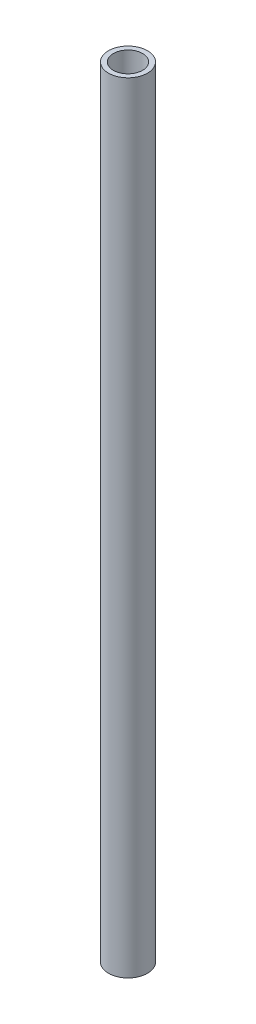
ISO-10303-21;
HEADER;
FILE_DESCRIPTION(('STEP AP214'),'2;1');
FILE_NAME('part.step','',(''),(''),'','','');
FILE_SCHEMA(('AUTOMOTIVE_DESIGN { 1 0 10303 214 1 1 1 1 }'));
ENDSEC;
DATA;
#1=APPLICATION_CONTEXT('core data for automotive mechanical design processes');
#2=APPLICATION_PROTOCOL_DEFINITION('international standard','automotive_design',2000,#1);
#3=PRODUCT_CONTEXT('',#1,'mechanical');
#4=PRODUCT('Part','Part','',(#3));
#5=PRODUCT_RELATED_PRODUCT_CATEGORY('part','',(#4));
#6=PRODUCT_DEFINITION_FORMATION('','',#4);
#7=PRODUCT_DEFINITION_CONTEXT('part definition',#1,'design');
#8=PRODUCT_DEFINITION('design','',#6,#7);
#9=PRODUCT_DEFINITION_SHAPE('','',#8);
#10=(LENGTH_UNIT() NAMED_UNIT(*) SI_UNIT(.MILLI.,.METRE.));
#11=(NAMED_UNIT(*) PLANE_ANGLE_UNIT() SI_UNIT($,.RADIAN.));
#12=(NAMED_UNIT(*) SI_UNIT($,.STERADIAN.) SOLID_ANGLE_UNIT());
#13=UNCERTAINTY_MEASURE_WITH_UNIT(LENGTH_MEASURE(1.E-05),#10,'distance_accuracy_value','');
#14=(GEOMETRIC_REPRESENTATION_CONTEXT(3) GLOBAL_UNCERTAINTY_ASSIGNED_CONTEXT((#13)) GLOBAL_UNIT_ASSIGNED_CONTEXT((#10,
#11,#12)) REPRESENTATION_CONTEXT('',''));
#15=CARTESIAN_POINT('',(0.,0.,0.));
#16=DIRECTION('',(0.,0.,1.));
#17=DIRECTION('',(1.,0.,0.));
#18=AXIS2_PLACEMENT_3D('',#15,#16,#17);
#19=CARTESIAN_POINT('',(0.,40.,0.));
#20=DIRECTION('',(0.,1.,0.));
#21=DIRECTION('',(0.,0.,1.));
#22=AXIS2_PLACEMENT_3D('',#19,#20,#21);
#23=PLANE('',#22);
#24=CARTESIAN_POINT('',(0.,40.,0.));
#25=DIRECTION('',(0.,1.,0.));
#26=DIRECTION('',(0.,0.,1.));
#27=AXIS2_PLACEMENT_3D('',#24,#25,#26);
#28=CIRCLE('',#27,2.);
#29=CARTESIAN_POINT('',(0.,40.,2.));
#30=VERTEX_POINT('',#29);
#31=EDGE_CURVE('E10',#30,#30,#28,.T.);
#32=ORIENTED_EDGE('',*,*,#31,.T.);
#33=EDGE_LOOP('',(#32));
#34=FACE_BOUND('',#33,.T.);
#35=CARTESIAN_POINT('',(0.,40.,0.));
#36=DIRECTION('',(0.,1.,0.));
#37=DIRECTION('',(0.,0.,1.));
#38=AXIS2_PLACEMENT_3D('',#35,#36,#37);
#39=CIRCLE('',#38,1.5);
#40=CARTESIAN_POINT('',(0.,40.,1.5));
#41=VERTEX_POINT('',#40);
#42=EDGE_CURVE('E46',#41,#41,#39,.T.);
#43=ORIENTED_EDGE('',*,*,#42,.F.);
#44=EDGE_LOOP('',(#43));
#45=FACE_BOUND('',#44,.T.);
#46=ADVANCED_FACE('F35',(#34,#45),#23,.T.);
#47=CARTESIAN_POINT('',(0.,-40.,0.));
#48=DIRECTION('',(0.,1.,0.));
#49=DIRECTION('',(0.,0.,1.));
#50=AXIS2_PLACEMENT_3D('',#47,#48,#49);
#51=PLANE('',#50);
#52=CARTESIAN_POINT('',(0.,-40.,0.));
#53=DIRECTION('',(0.,1.,0.));
#54=DIRECTION('',(0.,0.,1.));
#55=AXIS2_PLACEMENT_3D('',#52,#53,#54);
#56=CIRCLE('',#55,2.);
#57=CARTESIAN_POINT('',(0.,-40.,2.));
#58=VERTEX_POINT('',#57);
#59=EDGE_CURVE('E39',#58,#58,#56,.T.);
#60=ORIENTED_EDGE('',*,*,#59,.F.);
#61=EDGE_LOOP('',(#60));
#62=FACE_BOUND('',#61,.T.);
#63=CARTESIAN_POINT('',(0.,-40.,0.));
#64=DIRECTION('',(0.,1.,0.));
#65=DIRECTION('',(0.,0.,1.));
#66=AXIS2_PLACEMENT_3D('',#63,#64,#65);
#67=CIRCLE('',#66,1.5);
#68=CARTESIAN_POINT('',(0.,-40.,1.5));
#69=VERTEX_POINT('',#68);
#70=EDGE_CURVE('E48',#69,#69,#67,.T.);
#71=ORIENTED_EDGE('',*,*,#70,.T.);
#72=EDGE_LOOP('',(#71));
#73=FACE_BOUND('',#72,.T.);
#74=ADVANCED_FACE('F58',(#62,#73),#51,.F.);
#75=CARTESIAN_POINT('',(0.,40.,0.));
#76=DIRECTION('',(0.,-1.,0.));
#77=DIRECTION('',(0.,0.,-1.));
#78=AXIS2_PLACEMENT_3D('',#75,#76,#77);
#79=CYLINDRICAL_SURFACE('',#78,2.);
#80=ORIENTED_EDGE('',*,*,#31,.F.);
#81=EDGE_LOOP('',(#80));
#82=FACE_BOUND('',#81,.T.);
#83=ORIENTED_EDGE('',*,*,#59,.T.);
#84=EDGE_LOOP('',(#83));
#85=FACE_BOUND('',#84,.T.);
#86=ADVANCED_FACE('F37',(#82,#85),#79,.T.);
#87=CARTESIAN_POINT('',(0.,40.,0.));
#88=DIRECTION('',(0.,-1.,0.));
#89=DIRECTION('',(0.,0.,-1.));
#90=AXIS2_PLACEMENT_3D('',#87,#88,#89);
#91=CYLINDRICAL_SURFACE('',#90,1.5);
#92=ORIENTED_EDGE('',*,*,#42,.T.);
#93=EDGE_LOOP('',(#92));
#94=FACE_BOUND('',#93,.T.);
#95=ORIENTED_EDGE('',*,*,#70,.F.);
#96=EDGE_LOOP('',(#95));
#97=FACE_BOUND('',#96,.T.);
#98=ADVANCED_FACE('F54',(#94,#97),#91,.F.);
#99=CLOSED_SHELL('',(#46,#74,#86,#98));
#100=MANIFOLD_SOLID_BREP('B2',#99);
#101=ADVANCED_BREP_SHAPE_REPRESENTATION('',(#18,#100),#14);
#102=SHAPE_DEFINITION_REPRESENTATION(#9,#101);
ENDSEC;
END-ISO-10303-21;
